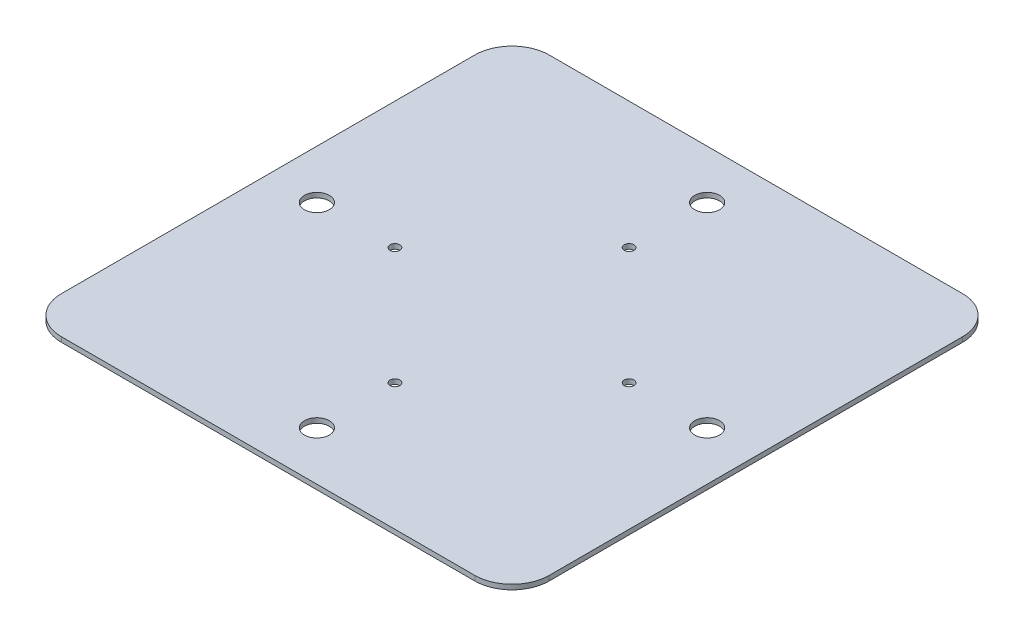
ISO-10303-21;
HEADER;
FILE_DESCRIPTION(('STEP AP214'),'2;1');
FILE_NAME('part.step','',(''),(''),'','','');
FILE_SCHEMA(('AUTOMOTIVE_DESIGN { 1 0 10303 214 1 1 1 1 }'));
ENDSEC;
DATA;
#1=APPLICATION_CONTEXT('core data for automotive mechanical design processes');
#2=APPLICATION_PROTOCOL_DEFINITION('international standard','automotive_design',2000,#1);
#3=PRODUCT_CONTEXT('',#1,'mechanical');
#4=PRODUCT('Part','Part','',(#3));
#5=PRODUCT_RELATED_PRODUCT_CATEGORY('part','',(#4));
#6=PRODUCT_DEFINITION_FORMATION('','',#4);
#7=PRODUCT_DEFINITION_CONTEXT('part definition',#1,'design');
#8=PRODUCT_DEFINITION('design','',#6,#7);
#9=PRODUCT_DEFINITION_SHAPE('','',#8);
#10=(LENGTH_UNIT() NAMED_UNIT(*) SI_UNIT(.MILLI.,.METRE.));
#11=(NAMED_UNIT(*) PLANE_ANGLE_UNIT() SI_UNIT($,.RADIAN.));
#12=(NAMED_UNIT(*) SI_UNIT($,.STERADIAN.) SOLID_ANGLE_UNIT());
#13=UNCERTAINTY_MEASURE_WITH_UNIT(LENGTH_MEASURE(1.E-05),#10,'distance_accuracy_value','');
#14=(GEOMETRIC_REPRESENTATION_CONTEXT(3) GLOBAL_UNCERTAINTY_ASSIGNED_CONTEXT((#13)) GLOBAL_UNIT_ASSIGNED_CONTEXT((#10,
#11,#12)) REPRESENTATION_CONTEXT('',''));
#15=CARTESIAN_POINT('',(0.,0.,0.));
#16=DIRECTION('',(0.,0.,1.));
#17=DIRECTION('',(1.,0.,0.));
#18=AXIS2_PLACEMENT_3D('',#15,#16,#17);
#19=CARTESIAN_POINT('',(42.38,1.,-42.38));
#20=DIRECTION('',(0.,-1.,0.));
#21=DIRECTION('',(0.,0.,-1.));
#22=AXIS2_PLACEMENT_3D('',#19,#20,#21);
#23=CYLINDRICAL_SURFACE('',#22,7.62);
#24=CARTESIAN_POINT('',(42.38,0.,-42.38));
#25=DIRECTION('',(0.,1.,0.));
#26=DIRECTION('',(0.,0.,-1.));
#27=AXIS2_PLACEMENT_3D('',#24,#25,#26);
#28=CIRCLE('',#27,7.62);
#29=CARTESIAN_POINT('',(50.,0.,-42.3799999999999));
#30=VERTEX_POINT('',#29);
#31=CARTESIAN_POINT('',(42.38,0.,-50.));
#32=VERTEX_POINT('',#31);
#33=EDGE_CURVE('E135',#30,#32,#28,.T.);
#34=ORIENTED_EDGE('',*,*,#33,.T.);
#35=DIRECTION('',(0.,-1.,0.));
#36=VECTOR('',#35,1.);
#37=CARTESIAN_POINT('',(42.38,1.,-50.));
#38=LINE('',#37,#36);
#39=CARTESIAN_POINT('',(42.38,1.,-50.));
#40=VERTEX_POINT('',#39);
#41=EDGE_CURVE('E11',#40,#32,#38,.T.);
#42=ORIENTED_EDGE('',*,*,#41,.F.);
#43=CARTESIAN_POINT('',(42.38,1.,-42.38));
#44=DIRECTION('',(0.,1.,0.));
#45=DIRECTION('',(0.,0.,-1.));
#46=AXIS2_PLACEMENT_3D('',#43,#44,#45);
#47=CIRCLE('',#46,7.62);
#48=CARTESIAN_POINT('',(50.,1.,-42.3799999999999));
#49=VERTEX_POINT('',#48);
#50=EDGE_CURVE('E150',#49,#40,#47,.T.);
#51=ORIENTED_EDGE('',*,*,#50,.F.);
#52=DIRECTION('',(0.,-1.,0.));
#53=VECTOR('',#52,1.);
#54=CARTESIAN_POINT('',(50.,1.,-42.3799999999999));
#55=LINE('',#54,#53);
#56=EDGE_CURVE('E131',#49,#30,#55,.T.);
#57=ORIENTED_EDGE('',*,*,#56,.T.);
#58=EDGE_LOOP('',(#34,#42,#51,#57));
#59=FACE_BOUND('',#58,.T.);
#60=ADVANCED_FACE('F37',(#59),#23,.T.);
#61=CARTESIAN_POINT('',(-42.3799999999999,1.,-50.));
#62=DIRECTION('',(0.,0.,1.));
#63=DIRECTION('',(1.,0.,0.));
#64=AXIS2_PLACEMENT_3D('',#61,#62,#63);
#65=PLANE('',#64);
#66=DIRECTION('',(-1.,0.,0.));
#67=VECTOR('',#66,1.);
#68=CARTESIAN_POINT('',(-42.3799999999999,0.,-50.));
#69=LINE('',#68,#67);
#70=CARTESIAN_POINT('',(-42.3799999999999,0.,-50.));
#71=VERTEX_POINT('',#70);
#72=EDGE_CURVE('E138',#32,#71,#69,.T.);
#73=ORIENTED_EDGE('',*,*,#72,.T.);
#74=DIRECTION('',(0.,-1.,0.));
#75=VECTOR('',#74,1.);
#76=CARTESIAN_POINT('',(-42.3799999999999,1.,-50.));
#77=LINE('',#76,#75);
#78=CARTESIAN_POINT('',(-42.3799999999999,1.,-50.));
#79=VERTEX_POINT('',#78);
#80=EDGE_CURVE('E46',#79,#71,#77,.T.);
#81=ORIENTED_EDGE('',*,*,#80,.F.);
#82=DIRECTION('',(-1.,0.,0.));
#83=VECTOR('',#82,1.);
#84=CARTESIAN_POINT('',(-42.3799999999999,1.,-50.));
#85=LINE('',#84,#83);
#86=EDGE_CURVE('E98',#40,#79,#85,.T.);
#87=ORIENTED_EDGE('',*,*,#86,.F.);
#88=ORIENTED_EDGE('',*,*,#41,.T.);
#89=EDGE_LOOP('',(#73,#81,#87,#88));
#90=FACE_BOUND('',#89,.T.);
#91=ADVANCED_FACE('F243',(#90),#65,.F.);
#92=CARTESIAN_POINT('',(-42.38,1.,-42.38));
#93=DIRECTION('',(0.,-1.,0.));
#94=DIRECTION('',(0.,0.,-1.));
#95=AXIS2_PLACEMENT_3D('',#92,#93,#94);
#96=CYLINDRICAL_SURFACE('',#95,7.62);
#97=CARTESIAN_POINT('',(-42.38,0.,-42.38));
#98=DIRECTION('',(0.,1.,0.));
#99=DIRECTION('',(0.,0.,-1.));
#100=AXIS2_PLACEMENT_3D('',#97,#98,#99);
#101=CIRCLE('',#100,7.62);
#102=CARTESIAN_POINT('',(-50.,0.,-42.3799999999999));
#103=VERTEX_POINT('',#102);
#104=EDGE_CURVE('E141',#71,#103,#101,.T.);
#105=ORIENTED_EDGE('',*,*,#104,.T.);
#106=DIRECTION('',(0.,-1.,0.));
#107=VECTOR('',#106,1.);
#108=CARTESIAN_POINT('',(-50.,1.,-42.3799999999999));
#109=LINE('',#108,#107);
#110=CARTESIAN_POINT('',(-50.,1.,-42.3799999999999));
#111=VERTEX_POINT('',#110);
#112=EDGE_CURVE('E157',#111,#103,#109,.T.);
#113=ORIENTED_EDGE('',*,*,#112,.F.);
#114=CARTESIAN_POINT('',(-42.38,1.,-42.38));
#115=DIRECTION('',(0.,1.,0.));
#116=DIRECTION('',(0.,0.,-1.));
#117=AXIS2_PLACEMENT_3D('',#114,#115,#116);
#118=CIRCLE('',#117,7.62);
#119=EDGE_CURVE('E211',#79,#111,#118,.T.);
#120=ORIENTED_EDGE('',*,*,#119,.F.);
#121=ORIENTED_EDGE('',*,*,#80,.T.);
#122=EDGE_LOOP('',(#105,#113,#120,#121));
#123=FACE_BOUND('',#122,.T.);
#124=ADVANCED_FACE('F247',(#123),#96,.T.);
#125=CARTESIAN_POINT('',(-50.,1.,42.3799999999999));
#126=DIRECTION('',(1.,0.,0.));
#127=DIRECTION('',(0.,0.,-1.));
#128=AXIS2_PLACEMENT_3D('',#125,#126,#127);
#129=PLANE('',#128);
#130=DIRECTION('',(0.,0.,1.));
#131=VECTOR('',#130,1.);
#132=CARTESIAN_POINT('',(-50.,0.,42.3799999999999));
#133=LINE('',#132,#131);
#134=CARTESIAN_POINT('',(-50.,0.,42.3799999999999));
#135=VERTEX_POINT('',#134);
#136=EDGE_CURVE('E143',#103,#135,#133,.T.);
#137=ORIENTED_EDGE('',*,*,#136,.T.);
#138=DIRECTION('',(0.,-1.,0.));
#139=VECTOR('',#138,1.);
#140=CARTESIAN_POINT('',(-50.,1.,42.3799999999999));
#141=LINE('',#140,#139);
#142=CARTESIAN_POINT('',(-50.,1.,42.3799999999999));
#143=VERTEX_POINT('',#142);
#144=EDGE_CURVE('E154',#143,#135,#141,.T.);
#145=ORIENTED_EDGE('',*,*,#144,.F.);
#146=DIRECTION('',(0.,0.,1.));
#147=VECTOR('',#146,1.);
#148=CARTESIAN_POINT('',(-50.,1.,42.3799999999999));
#149=LINE('',#148,#147);
#150=EDGE_CURVE('E213',#111,#143,#149,.T.);
#151=ORIENTED_EDGE('',*,*,#150,.F.);
#152=ORIENTED_EDGE('',*,*,#112,.T.);
#153=EDGE_LOOP('',(#137,#145,#151,#152));
#154=FACE_BOUND('',#153,.T.);
#155=ADVANCED_FACE('F219',(#154),#129,.F.);
#156=CARTESIAN_POINT('',(-42.38,1.,42.38));
#157=DIRECTION('',(0.,-1.,0.));
#158=DIRECTION('',(0.,0.,-1.));
#159=AXIS2_PLACEMENT_3D('',#156,#157,#158);
#160=CYLINDRICAL_SURFACE('',#159,7.62);
#161=CARTESIAN_POINT('',(-42.38,0.,42.38));
#162=DIRECTION('',(0.,1.,0.));
#163=DIRECTION('',(0.,0.,-1.));
#164=AXIS2_PLACEMENT_3D('',#161,#162,#163);
#165=CIRCLE('',#164,7.62);
#166=CARTESIAN_POINT('',(-42.3799999999999,0.,50.));
#167=VERTEX_POINT('',#166);
#168=EDGE_CURVE('E145',#135,#167,#165,.T.);
#169=ORIENTED_EDGE('',*,*,#168,.T.);
#170=DIRECTION('',(0.,-1.,0.));
#171=VECTOR('',#170,1.);
#172=CARTESIAN_POINT('',(-42.3799999999999,1.,50.));
#173=LINE('',#172,#171);
#174=CARTESIAN_POINT('',(-42.3799999999999,1.,50.));
#175=VERTEX_POINT('',#174);
#176=EDGE_CURVE('E126',#175,#167,#173,.T.);
#177=ORIENTED_EDGE('',*,*,#176,.F.);
#178=CARTESIAN_POINT('',(-42.38,1.,42.38));
#179=DIRECTION('',(0.,1.,0.));
#180=DIRECTION('',(0.,0.,-1.));
#181=AXIS2_PLACEMENT_3D('',#178,#179,#180);
#182=CIRCLE('',#181,7.62);
#183=EDGE_CURVE('E117',#143,#175,#182,.T.);
#184=ORIENTED_EDGE('',*,*,#183,.F.);
#185=ORIENTED_EDGE('',*,*,#144,.T.);
#186=EDGE_LOOP('',(#169,#177,#184,#185));
#187=FACE_BOUND('',#186,.T.);
#188=ADVANCED_FACE('F223',(#187),#160,.T.);
#189=CARTESIAN_POINT('',(-42.3799999999999,1.,50.));
#190=DIRECTION('',(0.,0.,-1.));
#191=DIRECTION('',(-1.,0.,0.));
#192=AXIS2_PLACEMENT_3D('',#189,#190,#191);
#193=PLANE('',#192);
#194=DIRECTION('',(1.,0.,0.));
#195=VECTOR('',#194,1.);
#196=CARTESIAN_POINT('',(-42.3799999999999,0.,50.));
#197=LINE('',#196,#195);
#198=CARTESIAN_POINT('',(42.38,0.,50.));
#199=VERTEX_POINT('',#198);
#200=EDGE_CURVE('E125',#167,#199,#197,.T.);
#201=ORIENTED_EDGE('',*,*,#200,.T.);
#202=DIRECTION('',(0.,-1.,0.));
#203=VECTOR('',#202,1.);
#204=CARTESIAN_POINT('',(42.38,1.,50.));
#205=LINE('',#204,#203);
#206=CARTESIAN_POINT('',(42.38,1.,50.));
#207=VERTEX_POINT('',#206);
#208=EDGE_CURVE('E122',#207,#199,#205,.T.);
#209=ORIENTED_EDGE('',*,*,#208,.F.);
#210=DIRECTION('',(1.,0.,0.));
#211=VECTOR('',#210,1.);
#212=CARTESIAN_POINT('',(-42.3799999999999,1.,50.));
#213=LINE('',#212,#211);
#214=EDGE_CURVE('E111',#175,#207,#213,.T.);
#215=ORIENTED_EDGE('',*,*,#214,.F.);
#216=ORIENTED_EDGE('',*,*,#176,.T.);
#217=EDGE_LOOP('',(#201,#209,#215,#216));
#218=FACE_BOUND('',#217,.T.);
#219=ADVANCED_FACE('F123',(#218),#193,.F.);
#220=CARTESIAN_POINT('',(42.38,1.,42.38));
#221=DIRECTION('',(0.,-1.,0.));
#222=DIRECTION('',(0.,0.,-1.));
#223=AXIS2_PLACEMENT_3D('',#220,#221,#222);
#224=CYLINDRICAL_SURFACE('',#223,7.62);
#225=CARTESIAN_POINT('',(42.38,0.,42.38));
#226=DIRECTION('',(0.,1.,0.));
#227=DIRECTION('',(0.,0.,1.));
#228=AXIS2_PLACEMENT_3D('',#225,#226,#227);
#229=CIRCLE('',#228,7.62);
#230=CARTESIAN_POINT('',(50.,0.,42.3799999999999));
#231=VERTEX_POINT('',#230);
#232=EDGE_CURVE('E84',#199,#231,#229,.T.);
#233=ORIENTED_EDGE('',*,*,#232,.T.);
#234=DIRECTION('',(0.,-1.,0.));
#235=VECTOR('',#234,1.);
#236=CARTESIAN_POINT('',(50.,1.,42.3799999999999));
#237=LINE('',#236,#235);
#238=CARTESIAN_POINT('',(50.,1.,42.3799999999999));
#239=VERTEX_POINT('',#238);
#240=EDGE_CURVE('E127',#239,#231,#237,.T.);
#241=ORIENTED_EDGE('',*,*,#240,.F.);
#242=CARTESIAN_POINT('',(42.38,1.,42.38));
#243=DIRECTION('',(0.,1.,0.));
#244=DIRECTION('',(0.,0.,1.));
#245=AXIS2_PLACEMENT_3D('',#242,#243,#244);
#246=CIRCLE('',#245,7.62);
#247=EDGE_CURVE('E115',#207,#239,#246,.T.);
#248=ORIENTED_EDGE('',*,*,#247,.F.);
#249=ORIENTED_EDGE('',*,*,#208,.T.);
#250=EDGE_LOOP('',(#233,#241,#248,#249));
#251=FACE_BOUND('',#250,.T.);
#252=ADVANCED_FACE('F129',(#251),#224,.T.);
#253=CARTESIAN_POINT('',(50.,1.,42.3799999999999));
#254=DIRECTION('',(-1.,0.,0.));
#255=DIRECTION('',(0.,0.,1.));
#256=AXIS2_PLACEMENT_3D('',#253,#254,#255);
#257=PLANE('',#256);
#258=DIRECTION('',(0.,0.,-1.));
#259=VECTOR('',#258,1.);
#260=CARTESIAN_POINT('',(50.,0.,42.3799999999999));
#261=LINE('',#260,#259);
#262=EDGE_CURVE('E90',#231,#30,#261,.T.);
#263=ORIENTED_EDGE('',*,*,#262,.T.);
#264=ORIENTED_EDGE('',*,*,#56,.F.);
#265=DIRECTION('',(0.,0.,-1.));
#266=VECTOR('',#265,1.);
#267=CARTESIAN_POINT('',(50.,1.,42.3799999999999));
#268=LINE('',#267,#266);
#269=EDGE_CURVE('E55',#239,#49,#268,.T.);
#270=ORIENTED_EDGE('',*,*,#269,.F.);
#271=ORIENTED_EDGE('',*,*,#240,.T.);
#272=EDGE_LOOP('',(#263,#264,#270,#271));
#273=FACE_BOUND('',#272,.T.);
#274=ADVANCED_FACE('F231',(#273),#257,.F.);
#275=CARTESIAN_POINT('',(42.38,1.,-42.38));
#276=DIRECTION('',(0.,-1.,0.));
#277=DIRECTION('',(0.,0.,-1.));
#278=AXIS2_PLACEMENT_3D('',#275,#276,#277);
#279=PLANE('',#278);
#280=CARTESIAN_POINT('',(-23.9999999999993,1.,6.82121026329696E-13));
#281=DIRECTION('',(0.,1.,0.));
#282=DIRECTION('',(0.,0.,1.));
#283=AXIS2_PLACEMENT_3D('',#280,#281,#282);
#284=CIRCLE('',#283,1.00000000000109);
#285=CARTESIAN_POINT('',(-23.9999999999993,1.,1.00000000000177));
#286=VERTEX_POINT('',#285);
#287=EDGE_CURVE('E196',#286,#286,#284,.T.);
#288=ORIENTED_EDGE('',*,*,#287,.F.);
#289=EDGE_LOOP('',(#288));
#290=FACE_BOUND('',#289,.T.);
#291=CARTESIAN_POINT('',(1.35836374802349E-12,1.,24.));
#292=DIRECTION('',(0.,1.,0.));
#293=DIRECTION('',(0.,0.,1.));
#294=AXIS2_PLACEMENT_3D('',#291,#292,#293);
#295=CIRCLE('',#294,1.00000000000146);
#296=CARTESIAN_POINT('',(1.35836374802349E-12,1.,25.0000000000015));
#297=VERTEX_POINT('',#296);
#298=EDGE_CURVE('E186',#297,#297,#295,.T.);
#299=ORIENTED_EDGE('',*,*,#298,.F.);
#300=EDGE_LOOP('',(#299));
#301=FACE_BOUND('',#300,.T.);
#302=CARTESIAN_POINT('',(24.0000000000007,1.,-6.79181874011743E-13));
#303=DIRECTION('',(0.,1.,0.));
#304=DIRECTION('',(0.,0.,1.));
#305=AXIS2_PLACEMENT_3D('',#302,#303,#304);
#306=CIRCLE('',#305,1.00000000000053);
#307=CARTESIAN_POINT('',(24.0000000000007,1.,0.999999999999853));
#308=VERTEX_POINT('',#307);
#309=EDGE_CURVE('E183',#308,#308,#306,.T.);
#310=ORIENTED_EDGE('',*,*,#309,.F.);
#311=EDGE_LOOP('',(#310));
#312=FACE_BOUND('',#311,.T.);
#313=CARTESIAN_POINT('',(0.,1.,-24.));
#314=DIRECTION('',(0.,1.,0.));
#315=DIRECTION('',(0.,0.,1.));
#316=AXIS2_PLACEMENT_3D('',#313,#314,#315);
#317=CIRCLE('',#316,1.);
#318=CARTESIAN_POINT('',(0.,1.,-23.));
#319=VERTEX_POINT('',#318);
#320=EDGE_CURVE('E180',#319,#319,#317,.T.);
#321=ORIENTED_EDGE('',*,*,#320,.F.);
#322=EDGE_LOOP('',(#321));
#323=FACE_BOUND('',#322,.T.);
#324=CARTESIAN_POINT('',(-40.,1.,-4.18977760661176E-13));
#325=DIRECTION('',(0.,1.,0.));
#326=DIRECTION('',(0.,0.,1.));
#327=AXIS2_PLACEMENT_3D('',#324,#325,#326);
#328=CIRCLE('',#327,2.55);
#329=CARTESIAN_POINT('',(-40.,1.,2.54999999999958));
#330=VERTEX_POINT('',#329);
#331=EDGE_CURVE('E176',#330,#330,#328,.T.);
#332=ORIENTED_EDGE('',*,*,#331,.F.);
#333=EDGE_LOOP('',(#332));
#334=FACE_BOUND('',#333,.T.);
#335=CARTESIAN_POINT('',(-2.79318507107451E-13,1.,40.));
#336=DIRECTION('',(0.,1.,0.));
#337=DIRECTION('',(0.,0.,1.));
#338=AXIS2_PLACEMENT_3D('',#335,#336,#337);
#339=CIRCLE('',#338,2.55);
#340=CARTESIAN_POINT('',(-2.79318507107451E-13,1.,42.55));
#341=VERTEX_POINT('',#340);
#342=EDGE_CURVE('E172',#341,#341,#339,.T.);
#343=ORIENTED_EDGE('',*,*,#342,.F.);
#344=EDGE_LOOP('',(#343));
#345=FACE_BOUND('',#344,.T.);
#346=CARTESIAN_POINT('',(40.,1.,1.39659253553725E-13));
#347=DIRECTION('',(0.,1.,0.));
#348=DIRECTION('',(0.,0.,1.));
#349=AXIS2_PLACEMENT_3D('',#346,#347,#348);
#350=CIRCLE('',#349,2.55);
#351=CARTESIAN_POINT('',(40.,1.,2.55000000000014));
#352=VERTEX_POINT('',#351);
#353=EDGE_CURVE('E168',#352,#352,#350,.T.);
#354=ORIENTED_EDGE('',*,*,#353,.F.);
#355=EDGE_LOOP('',(#354));
#356=FACE_BOUND('',#355,.T.);
#357=CARTESIAN_POINT('',(0.,1.,-40.));
#358=DIRECTION('',(0.,1.,0.));
#359=DIRECTION('',(0.,0.,1.));
#360=AXIS2_PLACEMENT_3D('',#357,#358,#359);
#361=CIRCLE('',#360,2.55);
#362=CARTESIAN_POINT('',(0.,1.,-37.45));
#363=VERTEX_POINT('',#362);
#364=EDGE_CURVE('E164',#363,#363,#361,.T.);
#365=ORIENTED_EDGE('',*,*,#364,.F.);
#366=EDGE_LOOP('',(#365));
#367=FACE_BOUND('',#366,.T.);
#368=ORIENTED_EDGE('',*,*,#50,.T.);
#369=ORIENTED_EDGE('',*,*,#86,.T.);
#370=ORIENTED_EDGE('',*,*,#119,.T.);
#371=ORIENTED_EDGE('',*,*,#150,.T.);
#372=ORIENTED_EDGE('',*,*,#183,.T.);
#373=ORIENTED_EDGE('',*,*,#214,.T.);
#374=ORIENTED_EDGE('',*,*,#247,.T.);
#375=ORIENTED_EDGE('',*,*,#269,.T.);
#376=EDGE_LOOP('',(#368,#369,#370,#371,#372,#373,#374,#375));
#377=FACE_BOUND('',#376,.T.);
#378=ADVANCED_FACE('F113',(#290,#301,#312,#323,#334,#345,#356,#367,#377),#279,.F.);
#379=CARTESIAN_POINT('',(42.38,0.,-42.38));
#380=DIRECTION('',(0.,-1.,0.));
#381=DIRECTION('',(0.,0.,-1.));
#382=AXIS2_PLACEMENT_3D('',#379,#380,#381);
#383=PLANE('',#382);
#384=CARTESIAN_POINT('',(-23.9999999999993,0.,6.82121026329696E-13));
#385=DIRECTION('',(0.,-1.,0.));
#386=DIRECTION('',(0.,0.,-1.));
#387=AXIS2_PLACEMENT_3D('',#384,#385,#386);
#388=CIRCLE('',#387,1.00000000000109);
#389=CARTESIAN_POINT('',(-23.9999999999993,0.,-1.00000000000041));
#390=VERTEX_POINT('',#389);
#391=EDGE_CURVE('E40',#390,#390,#388,.T.);
#392=ORIENTED_EDGE('',*,*,#391,.F.);
#393=EDGE_LOOP('',(#392));
#394=FACE_BOUND('',#393,.T.);
#395=CARTESIAN_POINT('',(1.35836374802349E-12,0.,24.));
#396=DIRECTION('',(0.,-1.,0.));
#397=DIRECTION('',(0.,0.,-1.));
#398=AXIS2_PLACEMENT_3D('',#395,#396,#397);
#399=CIRCLE('',#398,1.00000000000146);
#400=CARTESIAN_POINT('',(1.35836374802349E-12,0.,22.9999999999985));
#401=VERTEX_POINT('',#400);
#402=EDGE_CURVE('E184',#401,#401,#399,.T.);
#403=ORIENTED_EDGE('',*,*,#402,.F.);
#404=EDGE_LOOP('',(#403));
#405=FACE_BOUND('',#404,.T.);
#406=CARTESIAN_POINT('',(24.0000000000007,0.,-6.79181874011743E-13));
#407=DIRECTION('',(0.,-1.,0.));
#408=DIRECTION('',(0.,0.,-1.));
#409=AXIS2_PLACEMENT_3D('',#406,#407,#408);
#410=CIRCLE('',#409,1.00000000000053);
#411=CARTESIAN_POINT('',(24.0000000000007,0.,-1.00000000000121));
#412=VERTEX_POINT('',#411);
#413=EDGE_CURVE('E181',#412,#412,#410,.T.);
#414=ORIENTED_EDGE('',*,*,#413,.F.);
#415=EDGE_LOOP('',(#414));
#416=FACE_BOUND('',#415,.T.);
#417=CARTESIAN_POINT('',(0.,0.,-24.));
#418=DIRECTION('',(0.,-1.,0.));
#419=DIRECTION('',(0.,0.,-1.));
#420=AXIS2_PLACEMENT_3D('',#417,#418,#419);
#421=CIRCLE('',#420,1.);
#422=CARTESIAN_POINT('',(0.,0.,-25.));
#423=VERTEX_POINT('',#422);
#424=EDGE_CURVE('E177',#423,#423,#421,.T.);
#425=ORIENTED_EDGE('',*,*,#424,.F.);
#426=EDGE_LOOP('',(#425));
#427=FACE_BOUND('',#426,.T.);
#428=CARTESIAN_POINT('',(-40.,0.,-4.18977760661176E-13));
#429=DIRECTION('',(0.,-1.,0.));
#430=DIRECTION('',(0.,0.,-1.));
#431=AXIS2_PLACEMENT_3D('',#428,#429,#430);
#432=CIRCLE('',#431,2.55);
#433=CARTESIAN_POINT('',(-40.,0.,-2.55000000000042));
#434=VERTEX_POINT('',#433);
#435=EDGE_CURVE('E173',#434,#434,#432,.T.);
#436=ORIENTED_EDGE('',*,*,#435,.F.);
#437=EDGE_LOOP('',(#436));
#438=FACE_BOUND('',#437,.T.);
#439=CARTESIAN_POINT('',(-2.79318507107451E-13,0.,40.));
#440=DIRECTION('',(0.,-1.,0.));
#441=DIRECTION('',(0.,0.,-1.));
#442=AXIS2_PLACEMENT_3D('',#439,#440,#441);
#443=CIRCLE('',#442,2.55);
#444=CARTESIAN_POINT('',(-2.79318507107451E-13,0.,37.45));
#445=VERTEX_POINT('',#444);
#446=EDGE_CURVE('E169',#445,#445,#443,.T.);
#447=ORIENTED_EDGE('',*,*,#446,.F.);
#448=EDGE_LOOP('',(#447));
#449=FACE_BOUND('',#448,.T.);
#450=CARTESIAN_POINT('',(40.,0.,1.39659253553725E-13));
#451=DIRECTION('',(0.,-1.,0.));
#452=DIRECTION('',(0.,0.,-1.));
#453=AXIS2_PLACEMENT_3D('',#450,#451,#452);
#454=CIRCLE('',#453,2.55);
#455=CARTESIAN_POINT('',(40.,0.,-2.54999999999986));
#456=VERTEX_POINT('',#455);
#457=EDGE_CURVE('E165',#456,#456,#454,.T.);
#458=ORIENTED_EDGE('',*,*,#457,.F.);
#459=EDGE_LOOP('',(#458));
#460=FACE_BOUND('',#459,.T.);
#461=CARTESIAN_POINT('',(0.,0.,-40.));
#462=DIRECTION('',(0.,-1.,0.));
#463=DIRECTION('',(0.,0.,-1.));
#464=AXIS2_PLACEMENT_3D('',#461,#462,#463);
#465=CIRCLE('',#464,2.55);
#466=CARTESIAN_POINT('',(0.,0.,-42.55));
#467=VERTEX_POINT('',#466);
#468=EDGE_CURVE('E139',#467,#467,#465,.T.);
#469=ORIENTED_EDGE('',*,*,#468,.F.);
#470=EDGE_LOOP('',(#469));
#471=FACE_BOUND('',#470,.T.);
#472=ORIENTED_EDGE('',*,*,#33,.F.);
#473=ORIENTED_EDGE('',*,*,#262,.F.);
#474=ORIENTED_EDGE('',*,*,#232,.F.);
#475=ORIENTED_EDGE('',*,*,#200,.F.);
#476=ORIENTED_EDGE('',*,*,#168,.F.);
#477=ORIENTED_EDGE('',*,*,#136,.F.);
#478=ORIENTED_EDGE('',*,*,#104,.F.);
#479=ORIENTED_EDGE('',*,*,#72,.F.);
#480=EDGE_LOOP('',(#472,#473,#474,#475,#476,#477,#478,#479));
#481=FACE_BOUND('',#480,.T.);
#482=ADVANCED_FACE('F226',(#394,#405,#416,#427,#438,#449,#460,#471,#481),#383,.T.);
#483=CARTESIAN_POINT('',(0.,-1.54,-40.));
#484=DIRECTION('',(0.,1.,0.));
#485=DIRECTION('',(0.,0.,1.));
#486=AXIS2_PLACEMENT_3D('',#483,#484,#485);
#487=CYLINDRICAL_SURFACE('',#486,2.55);
#488=ORIENTED_EDGE('',*,*,#468,.T.);
#489=EDGE_LOOP('',(#488));
#490=FACE_BOUND('',#489,.T.);
#491=ORIENTED_EDGE('',*,*,#364,.T.);
#492=EDGE_LOOP('',(#491));
#493=FACE_BOUND('',#492,.T.);
#494=ADVANCED_FACE('F277',(#490,#493),#487,.F.);
#495=CARTESIAN_POINT('',(40.,-1.54,1.39659253553725E-13));
#496=DIRECTION('',(0.,1.,0.));
#497=DIRECTION('',(0.,0.,1.));
#498=AXIS2_PLACEMENT_3D('',#495,#496,#497);
#499=CYLINDRICAL_SURFACE('',#498,2.55);
#500=ORIENTED_EDGE('',*,*,#457,.T.);
#501=EDGE_LOOP('',(#500));
#502=FACE_BOUND('',#501,.T.);
#503=ORIENTED_EDGE('',*,*,#353,.T.);
#504=EDGE_LOOP('',(#503));
#505=FACE_BOUND('',#504,.T.);
#506=ADVANCED_FACE('F282',(#502,#505),#499,.F.);
#507=CARTESIAN_POINT('',(-2.79318507107451E-13,-1.54,40.));
#508=DIRECTION('',(0.,1.,0.));
#509=DIRECTION('',(0.,0.,1.));
#510=AXIS2_PLACEMENT_3D('',#507,#508,#509);
#511=CYLINDRICAL_SURFACE('',#510,2.55);
#512=ORIENTED_EDGE('',*,*,#446,.T.);
#513=EDGE_LOOP('',(#512));
#514=FACE_BOUND('',#513,.T.);
#515=ORIENTED_EDGE('',*,*,#342,.T.);
#516=EDGE_LOOP('',(#515));
#517=FACE_BOUND('',#516,.T.);
#518=ADVANCED_FACE('F294',(#514,#517),#511,.F.);
#519=CARTESIAN_POINT('',(-40.,-1.54,-4.18977760661176E-13));
#520=DIRECTION('',(0.,1.,0.));
#521=DIRECTION('',(0.,0.,1.));
#522=AXIS2_PLACEMENT_3D('',#519,#520,#521);
#523=CYLINDRICAL_SURFACE('',#522,2.55);
#524=ORIENTED_EDGE('',*,*,#435,.T.);
#525=EDGE_LOOP('',(#524));
#526=FACE_BOUND('',#525,.T.);
#527=ORIENTED_EDGE('',*,*,#331,.T.);
#528=EDGE_LOOP('',(#527));
#529=FACE_BOUND('',#528,.T.);
#530=ADVANCED_FACE('F304',(#526,#529),#523,.F.);
#531=CARTESIAN_POINT('',(0.,-1.54,-24.));
#532=DIRECTION('',(0.,1.,0.));
#533=DIRECTION('',(0.,0.,1.));
#534=AXIS2_PLACEMENT_3D('',#531,#532,#533);
#535=CYLINDRICAL_SURFACE('',#534,1.);
#536=ORIENTED_EDGE('',*,*,#424,.T.);
#537=EDGE_LOOP('',(#536));
#538=FACE_BOUND('',#537,.T.);
#539=ORIENTED_EDGE('',*,*,#320,.T.);
#540=EDGE_LOOP('',(#539));
#541=FACE_BOUND('',#540,.T.);
#542=ADVANCED_FACE('F314',(#538,#541),#535,.F.);
#543=CARTESIAN_POINT('',(24.0000000000007,-1.54,-6.79181874011743E-13));
#544=DIRECTION('',(0.,1.,0.));
#545=DIRECTION('',(0.,0.,1.));
#546=AXIS2_PLACEMENT_3D('',#543,#544,#545);
#547=CYLINDRICAL_SURFACE('',#546,1.00000000000053);
#548=ORIENTED_EDGE('',*,*,#413,.T.);
#549=EDGE_LOOP('',(#548));
#550=FACE_BOUND('',#549,.T.);
#551=ORIENTED_EDGE('',*,*,#309,.T.);
#552=EDGE_LOOP('',(#551));
#553=FACE_BOUND('',#552,.T.);
#554=ADVANCED_FACE('F335',(#550,#553),#547,.F.);
#555=CARTESIAN_POINT('',(1.35836374802349E-12,-1.54,24.));
#556=DIRECTION('',(0.,1.,0.));
#557=DIRECTION('',(0.,0.,1.));
#558=AXIS2_PLACEMENT_3D('',#555,#556,#557);
#559=CYLINDRICAL_SURFACE('',#558,1.00000000000146);
#560=ORIENTED_EDGE('',*,*,#402,.T.);
#561=EDGE_LOOP('',(#560));
#562=FACE_BOUND('',#561,.T.);
#563=ORIENTED_EDGE('',*,*,#298,.T.);
#564=EDGE_LOOP('',(#563));
#565=FACE_BOUND('',#564,.T.);
#566=ADVANCED_FACE('F345',(#562,#565),#559,.F.);
#567=CARTESIAN_POINT('',(-23.9999999999993,-1.54,6.82121026329696E-13));
#568=DIRECTION('',(0.,1.,0.));
#569=DIRECTION('',(0.,0.,1.));
#570=AXIS2_PLACEMENT_3D('',#567,#568,#569);
#571=CYLINDRICAL_SURFACE('',#570,1.00000000000109);
#572=ORIENTED_EDGE('',*,*,#391,.T.);
#573=EDGE_LOOP('',(#572));
#574=FACE_BOUND('',#573,.T.);
#575=ORIENTED_EDGE('',*,*,#287,.T.);
#576=EDGE_LOOP('',(#575));
#577=FACE_BOUND('',#576,.T.);
#578=ADVANCED_FACE('F355',(#574,#577),#571,.F.);
#579=CLOSED_SHELL('',(#60,#91,#124,#155,#188,#219,#252,#274,#378,#482,#494,#506,#518,#530,#542,
#554,#566,#578));
#580=MANIFOLD_SOLID_BREP('B2',#579);
#581=ADVANCED_BREP_SHAPE_REPRESENTATION('',(#18,#580),#14);
#582=SHAPE_DEFINITION_REPRESENTATION(#9,#581);
ENDSEC;
END-ISO-10303-21;
